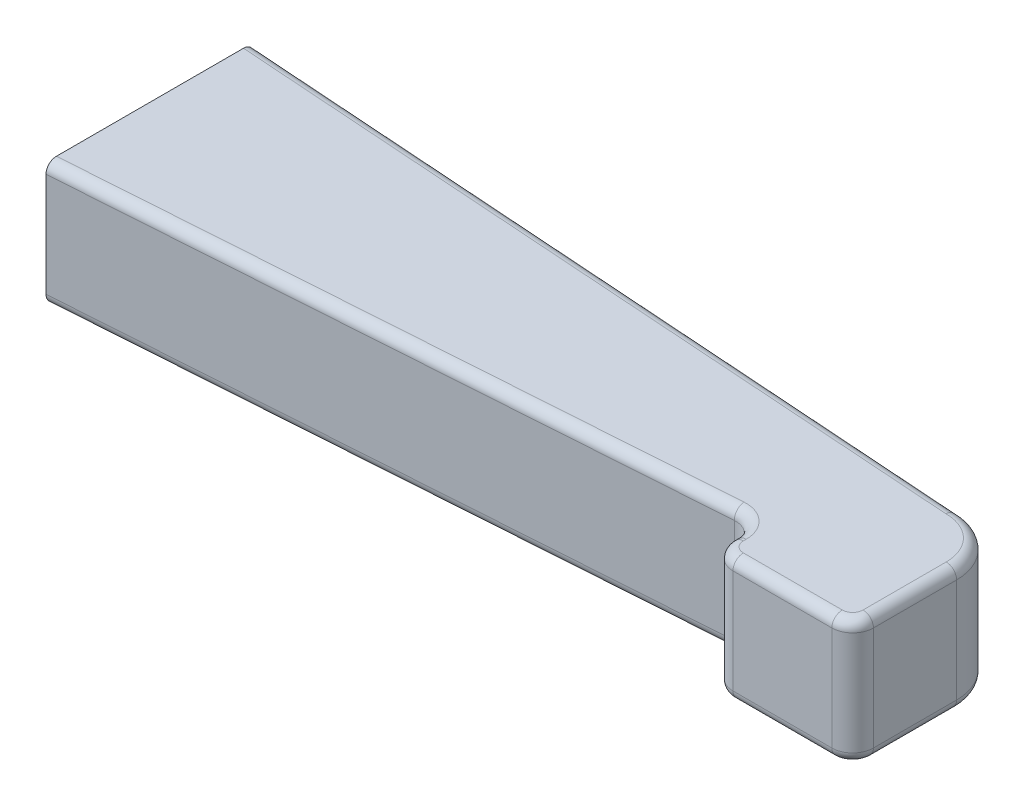
ISO-10303-21;
HEADER;
FILE_DESCRIPTION(('STEP AP214'),'2;1');
FILE_NAME('part.step','',(''),(''),'','','');
FILE_SCHEMA(('AUTOMOTIVE_DESIGN { 1 0 10303 214 1 1 1 1 }'));
ENDSEC;
DATA;
#1=APPLICATION_CONTEXT('core data for automotive mechanical design processes');
#2=APPLICATION_PROTOCOL_DEFINITION('international standard','automotive_design',2000,#1);
#3=PRODUCT_CONTEXT('',#1,'mechanical');
#4=PRODUCT('Part','Part','',(#3));
#5=PRODUCT_RELATED_PRODUCT_CATEGORY('part','',(#4));
#6=PRODUCT_DEFINITION_FORMATION('','',#4);
#7=PRODUCT_DEFINITION_CONTEXT('part definition',#1,'design');
#8=PRODUCT_DEFINITION('design','',#6,#7);
#9=PRODUCT_DEFINITION_SHAPE('','',#8);
#10=(LENGTH_UNIT() NAMED_UNIT(*) SI_UNIT(.MILLI.,.METRE.));
#11=(NAMED_UNIT(*) PLANE_ANGLE_UNIT() SI_UNIT($,.RADIAN.));
#12=(NAMED_UNIT(*) SI_UNIT($,.STERADIAN.) SOLID_ANGLE_UNIT());
#13=UNCERTAINTY_MEASURE_WITH_UNIT(LENGTH_MEASURE(1.E-05),#10,'distance_accuracy_value','');
#14=(GEOMETRIC_REPRESENTATION_CONTEXT(3) GLOBAL_UNCERTAINTY_ASSIGNED_CONTEXT((#13)) GLOBAL_UNIT_ASSIGNED_CONTEXT((#10,
#11,#12)) REPRESENTATION_CONTEXT('',''));
#15=CARTESIAN_POINT('',(0.,0.,0.));
#16=DIRECTION('',(0.,0.,1.));
#17=DIRECTION('',(1.,0.,0.));
#18=AXIS2_PLACEMENT_3D('',#15,#16,#17);
#19=CARTESIAN_POINT('',(0.,6.,0.));
#20=DIRECTION('',(-0.0687070111034064,0.,-0.997636881147262));
#21=DIRECTION('',(-0.997636881147262,0.,0.0687070111034064));
#22=AXIS2_PLACEMENT_3D('',#19,#20,#21);
#23=PLANE('',#22);
#24=DIRECTION('',(0.,-1.,0.));
#25=VECTOR('',#24,1.);
#26=CARTESIAN_POINT('',(0.,6.,0.));
#27=LINE('',#26,#25);
#28=CARTESIAN_POINT('',(0.,5.5,0.));
#29=VERTEX_POINT('',#28);
#30=CARTESIAN_POINT('',(0.,0.5,0.));
#31=VERTEX_POINT('',#30);
#32=EDGE_CURVE('E255',#29,#31,#27,.T.);
#33=ORIENTED_EDGE('',*,*,#32,.T.);
#34=DIRECTION('',(0.997636881147262,0.,-0.0687070111034064));
#35=VECTOR('',#34,1.);
#36=CARTESIAN_POINT('',(30.9748855071722,0.5,-2.13323288531659));
#37=LINE('',#36,#35);
#38=CARTESIAN_POINT('',(30.9748855071722,0.5,-2.13323288531659));
#39=VERTEX_POINT('',#38);
#40=EDGE_CURVE('E11',#31,#39,#37,.T.);
#41=ORIENTED_EDGE('',*,*,#40,.T.);
#42=DIRECTION('',(0.,-1.,0.));
#43=VECTOR('',#42,1.);
#44=CARTESIAN_POINT('',(30.9748855071722,6.,-2.13323288531659));
#45=LINE('',#44,#43);
#46=CARTESIAN_POINT('',(30.9748855071722,5.5,-2.13323288531659));
#47=VERTEX_POINT('',#46);
#48=EDGE_CURVE('E271',#39,#47,#45,.F.);
#49=ORIENTED_EDGE('',*,*,#48,.T.);
#50=DIRECTION('',(0.997636881147262,0.,-0.0687070111034064));
#51=VECTOR('',#50,1.);
#52=CARTESIAN_POINT('',(0.,5.5,0.));
#53=LINE('',#52,#51);
#54=EDGE_CURVE('E53',#47,#29,#53,.F.);
#55=ORIENTED_EDGE('',*,*,#54,.T.);
#56=EDGE_LOOP('',(#33,#41,#49,#55));
#57=FACE_BOUND('',#56,.T.);
#58=ADVANCED_FACE('F39',(#57),#23,.F.);
#59=CARTESIAN_POINT('',(0.,6.,0.));
#60=DIRECTION('',(1.,0.,0.));
#61=DIRECTION('',(0.,0.,-1.));
#62=AXIS2_PLACEMENT_3D('',#59,#60,#61);
#63=PLANE('',#62);
#64=DIRECTION('',(0.,-1.,0.));
#65=VECTOR('',#64,1.);
#66=CARTESIAN_POINT('',(0.,6.,-10.));
#67=LINE('',#66,#65);
#68=CARTESIAN_POINT('',(0.,5.5,-10.));
#69=VERTEX_POINT('',#68);
#70=CARTESIAN_POINT('',(0.,0.5,-10.));
#71=VERTEX_POINT('',#70);
#72=EDGE_CURVE('E259',#69,#71,#67,.T.);
#73=ORIENTED_EDGE('',*,*,#72,.T.);
#74=CARTESIAN_POINT('',(0.,0.5,-9.49881564179443));
#75=DIRECTION('',(1.,0.,0.));
#76=DIRECTION('',(0.,0.,1.));
#77=AXIS2_PLACEMENT_3D('',#74,#75,#76);
#78=ELLIPSE('',#77,0.501184358205573,0.5);
#79=CARTESIAN_POINT('',(0.,0.,-9.49881564179443));
#80=VERTEX_POINT('',#79);
#81=EDGE_CURVE('E334',#71,#80,#78,.F.);
#82=ORIENTED_EDGE('',*,*,#81,.T.);
#83=DIRECTION('',(0.,0.,1.));
#84=VECTOR('',#83,1.);
#85=CARTESIAN_POINT('',(0.,0.,0.));
#86=LINE('',#85,#84);
#87=CARTESIAN_POINT('',(0.,0.,-0.501184358205573));
#88=VERTEX_POINT('',#87);
#89=EDGE_CURVE('E247',#80,#88,#86,.T.);
#90=ORIENTED_EDGE('',*,*,#89,.T.);
#91=CARTESIAN_POINT('',(0.,0.5,-0.501184358205573));
#92=DIRECTION('',(1.,0.,0.));
#93=DIRECTION('',(0.,0.,1.));
#94=AXIS2_PLACEMENT_3D('',#91,#92,#93);
#95=ELLIPSE('',#94,0.501184358205573,0.5);
#96=EDGE_CURVE('E332',#88,#31,#95,.F.);
#97=ORIENTED_EDGE('',*,*,#96,.T.);
#98=ORIENTED_EDGE('',*,*,#32,.F.);
#99=CARTESIAN_POINT('',(0.,5.5,-0.501184358205574));
#100=DIRECTION('',(1.,0.,0.));
#101=DIRECTION('',(0.,0.,-1.));
#102=AXIS2_PLACEMENT_3D('',#99,#100,#101);
#103=ELLIPSE('',#102,0.501184358205573,0.5);
#104=CARTESIAN_POINT('',(0.,6.,-0.501184358205574));
#105=VERTEX_POINT('',#104);
#106=EDGE_CURVE('E328',#29,#105,#103,.F.);
#107=ORIENTED_EDGE('',*,*,#106,.T.);
#108=DIRECTION('',(0.,0.,1.));
#109=VECTOR('',#108,1.);
#110=CARTESIAN_POINT('',(0.,6.,0.));
#111=LINE('',#110,#109);
#112=CARTESIAN_POINT('',(0.,6.,-9.49881564179443));
#113=VERTEX_POINT('',#112);
#114=EDGE_CURVE('E252',#113,#105,#111,.T.);
#115=ORIENTED_EDGE('',*,*,#114,.F.);
#116=CARTESIAN_POINT('',(0.,5.5,-9.49881564179443));
#117=DIRECTION('',(1.,0.,0.));
#118=DIRECTION('',(0.,0.,-1.));
#119=AXIS2_PLACEMENT_3D('',#116,#117,#118);
#120=ELLIPSE('',#119,0.501184358205573,0.5);
#121=EDGE_CURVE('E330',#113,#69,#120,.F.);
#122=ORIENTED_EDGE('',*,*,#121,.T.);
#123=EDGE_LOOP('',(#73,#82,#90,#97,#98,#107,#115,#122));
#124=FACE_BOUND('',#123,.T.);
#125=DIRECTION('',(0.,0.,-1.));
#126=VECTOR('',#125,1.);
#127=CARTESIAN_POINT('',(0.,4.125,-8.25));
#128=LINE('',#127,#126);
#129=CARTESIAN_POINT('',(0.,4.125,-1.75));
#130=VERTEX_POINT('',#129);
#131=CARTESIAN_POINT('',(0.,4.125,-8.25));
#132=VERTEX_POINT('',#131);
#133=EDGE_CURVE('E218',#130,#132,#128,.T.);
#134=ORIENTED_EDGE('',*,*,#133,.F.);
#135=DIRECTION('',(0.,-1.,0.));
#136=VECTOR('',#135,1.);
#137=CARTESIAN_POINT('',(0.,4.125,-1.75));
#138=LINE('',#137,#136);
#139=CARTESIAN_POINT('',(0.,1.875,-1.75));
#140=VERTEX_POINT('',#139);
#141=EDGE_CURVE('E248',#130,#140,#138,.T.);
#142=ORIENTED_EDGE('',*,*,#141,.T.);
#143=DIRECTION('',(0.,0.,-1.));
#144=VECTOR('',#143,1.);
#145=CARTESIAN_POINT('',(0.,1.875,-8.25));
#146=LINE('',#145,#144);
#147=CARTESIAN_POINT('',(0.,1.875,-8.25));
#148=VERTEX_POINT('',#147);
#149=EDGE_CURVE('E231',#140,#148,#146,.T.);
#150=ORIENTED_EDGE('',*,*,#149,.T.);
#151=DIRECTION('',(0.,-1.,0.));
#152=VECTOR('',#151,1.);
#153=CARTESIAN_POINT('',(0.,4.125,-8.25));
#154=LINE('',#153,#152);
#155=EDGE_CURVE('E245',#132,#148,#154,.T.);
#156=ORIENTED_EDGE('',*,*,#155,.F.);
#157=EDGE_LOOP('',(#134,#142,#150,#156));
#158=FACE_BOUND('',#157,.T.);
#159=ADVANCED_FACE('F442',(#124,#158),#63,.F.);
#160=CARTESIAN_POINT('',(36.300403158485,6.,-5.));
#161=DIRECTION('',(0.,-1.,0.));
#162=DIRECTION('',(0.,0.,-1.));
#163=AXIS2_PLACEMENT_3D('',#160,#161,#162);
#164=CYLINDRICAL_SURFACE('',#163,2.5);
#165=DIRECTION('',(0.,1.,0.));
#166=VECTOR('',#165,1.);
#167=CARTESIAN_POINT('',(38.800403158485,6.,-5.));
#168=LINE('',#167,#166);
#169=CARTESIAN_POINT('',(38.800403158485,0.5,-5.));
#170=VERTEX_POINT('',#169);
#171=CARTESIAN_POINT('',(38.800403158485,5.5,-5.));
#172=VERTEX_POINT('',#171);
#173=EDGE_CURVE('E237',#170,#172,#168,.T.);
#174=ORIENTED_EDGE('',*,*,#173,.F.);
#175=CARTESIAN_POINT('',(36.300403158485,0.5,-5.));
#176=DIRECTION('',(0.,-1.,0.));
#177=DIRECTION('',(0.,0.,-1.));
#178=AXIS2_PLACEMENT_3D('',#175,#176,#177);
#179=CIRCLE('',#178,2.5);
#180=CARTESIAN_POINT('',(36.300403158485,0.5,-7.5));
#181=VERTEX_POINT('',#180);
#182=EDGE_CURVE('E338',#170,#181,#179,.F.);
#183=ORIENTED_EDGE('',*,*,#182,.T.);
#184=DIRECTION('',(0.,-1.,0.));
#185=VECTOR('',#184,1.);
#186=CARTESIAN_POINT('',(36.300403158485,6.,-7.5));
#187=LINE('',#186,#185);
#188=CARTESIAN_POINT('',(36.300403158485,5.5,-7.5));
#189=VERTEX_POINT('',#188);
#190=EDGE_CURVE('E262',#189,#181,#187,.T.);
#191=ORIENTED_EDGE('',*,*,#190,.F.);
#192=CARTESIAN_POINT('',(36.300403158485,5.5,-5.));
#193=DIRECTION('',(0.,-1.,0.));
#194=DIRECTION('',(0.,0.,-1.));
#195=AXIS2_PLACEMENT_3D('',#192,#193,#194);
#196=CIRCLE('',#195,2.5);
#197=EDGE_CURVE('E336',#189,#172,#196,.T.);
#198=ORIENTED_EDGE('',*,*,#197,.T.);
#199=EDGE_LOOP('',(#174,#183,#191,#198));
#200=FACE_BOUND('',#199,.T.);
#201=ADVANCED_FACE('F447',(#200),#164,.T.);
#202=CARTESIAN_POINT('',(0.,6.,-10.));
#203=DIRECTION('',(-0.0687070111034064,0.,0.997636881147262));
#204=DIRECTION('',(0.997636881147262,0.,0.0687070111034064));
#205=AXIS2_PLACEMENT_3D('',#202,#203,#204);
#206=PLANE('',#205);
#207=ORIENTED_EDGE('',*,*,#190,.T.);
#208=DIRECTION('',(-0.997636881147262,0.,-0.0687070111034064));
#209=VECTOR('',#208,1.);
#210=CARTESIAN_POINT('',(0.,0.5,-10.));
#211=LINE('',#210,#209);
#212=EDGE_CURVE('E326',#181,#71,#211,.T.);
#213=ORIENTED_EDGE('',*,*,#212,.T.);
#214=ORIENTED_EDGE('',*,*,#72,.F.);
#215=DIRECTION('',(-0.997636881147262,0.,-0.0687070111034064));
#216=VECTOR('',#215,1.);
#217=CARTESIAN_POINT('',(0.,5.5,-10.));
#218=LINE('',#217,#216);
#219=EDGE_CURVE('E324',#69,#189,#218,.F.);
#220=ORIENTED_EDGE('',*,*,#219,.T.);
#221=EDGE_LOOP('',(#207,#213,#214,#220));
#222=FACE_BOUND('',#221,.T.);
#223=ADVANCED_FACE('F503',(#222),#206,.F.);
#224=CARTESIAN_POINT('',(36.300403158485,6.,-5.));
#225=DIRECTION('',(0.,-1.,0.));
#226=DIRECTION('',(0.,0.,-1.));
#227=AXIS2_PLACEMENT_3D('',#224,#225,#226);
#228=PLANE('',#227);
#229=CARTESIAN_POINT('',(36.300403158485,6.,-5.));
#230=DIRECTION('',(0.,-1.,0.));
#231=DIRECTION('',(0.,0.,-1.));
#232=AXIS2_PLACEMENT_3D('',#229,#230,#231);
#233=CIRCLE('',#232,2.);
#234=CARTESIAN_POINT('',(38.300403158485,6.,-5.));
#235=VERTEX_POINT('',#234);
#236=CARTESIAN_POINT('',(36.2841634462838,6.,-6.99993406685011));
#237=VERTEX_POINT('',#236);
#238=EDGE_CURVE('E320',#235,#237,#233,.F.);
#239=ORIENTED_EDGE('',*,*,#238,.T.);
#240=DIRECTION('',(-0.997636881147262,0.,-0.0687070111034064));
#241=VECTOR('',#240,1.);
#242=CARTESIAN_POINT('',(36.4374112736087,6.,-6.98937992598946));
#243=LINE('',#242,#241);
#244=EDGE_CURVE('E322',#237,#113,#243,.T.);
#245=ORIENTED_EDGE('',*,*,#244,.T.);
#246=ORIENTED_EDGE('',*,*,#114,.T.);
#247=DIRECTION('',(0.997636881147262,0.,-0.0687070111034064));
#248=VECTOR('',#247,1.);
#249=CARTESIAN_POINT('',(36.4374112736087,6.,-3.01062007401054));
#250=LINE('',#249,#248);
#251=CARTESIAN_POINT('',(30.9405320016205,6.,-2.63205132589023));
#252=VERTEX_POINT('',#251);
#253=EDGE_CURVE('E306',#105,#252,#250,.T.);
#254=ORIENTED_EDGE('',*,*,#253,.T.);
#255=CARTESIAN_POINT('',(31.0435925182756,6.,-1.13559600416933));
#256=DIRECTION('',(0.,-1.,0.));
#257=DIRECTION('',(0.,0.,-1.));
#258=AXIS2_PLACEMENT_3D('',#255,#256,#257);
#259=CIRCLE('',#258,1.5);
#260=CARTESIAN_POINT('',(32.5435925182756,6.,-1.13559600416933));
#261=VERTEX_POINT('',#260);
#262=EDGE_CURVE('E308',#252,#261,#259,.T.);
#263=ORIENTED_EDGE('',*,*,#262,.T.);
#264=DIRECTION('',(0.,0.,-1.));
#265=VECTOR('',#264,1.);
#266=CARTESIAN_POINT('',(32.5435925182756,6.,-5.));
#267=LINE('',#266,#265);
#268=CARTESIAN_POINT('',(32.5435925182756,6.,-1.));
#269=VERTEX_POINT('',#268);
#270=EDGE_CURVE('E310',#261,#269,#267,.F.);
#271=ORIENTED_EDGE('',*,*,#270,.T.);
#272=CARTESIAN_POINT('',(33.0435925182756,6.,-1.));
#273=DIRECTION('',(0.,-1.,0.));
#274=DIRECTION('',(0.,0.,-1.));
#275=AXIS2_PLACEMENT_3D('',#272,#273,#274);
#276=CIRCLE('',#275,0.5);
#277=CARTESIAN_POINT('',(33.0435925182756,6.,-0.5));
#278=VERTEX_POINT('',#277);
#279=EDGE_CURVE('E312',#269,#278,#276,.F.);
#280=ORIENTED_EDGE('',*,*,#279,.T.);
#281=DIRECTION('',(-1.,0.,0.));
#282=VECTOR('',#281,1.);
#283=CARTESIAN_POINT('',(36.300403158485,6.,-0.5));
#284=LINE('',#283,#282);
#285=CARTESIAN_POINT('',(37.800403158485,6.,-0.5));
#286=VERTEX_POINT('',#285);
#287=EDGE_CURVE('E314',#278,#286,#284,.F.);
#288=ORIENTED_EDGE('',*,*,#287,.T.);
#289=CARTESIAN_POINT('',(37.800403158485,6.,-1.));
#290=DIRECTION('',(0.,-1.,0.));
#291=DIRECTION('',(0.,0.,-1.));
#292=AXIS2_PLACEMENT_3D('',#289,#290,#291);
#293=CIRCLE('',#292,0.5);
#294=CARTESIAN_POINT('',(38.300403158485,6.,-1.));
#295=VERTEX_POINT('',#294);
#296=EDGE_CURVE('E316',#286,#295,#293,.F.);
#297=ORIENTED_EDGE('',*,*,#296,.T.);
#298=DIRECTION('',(0.,0.,-1.));
#299=VECTOR('',#298,1.);
#300=CARTESIAN_POINT('',(38.300403158485,6.,-5.));
#301=LINE('',#300,#299);
#302=EDGE_CURVE('E318',#295,#235,#301,.T.);
#303=ORIENTED_EDGE('',*,*,#302,.T.);
#304=EDGE_LOOP('',(#239,#245,#246,#254,#263,#271,#280,#288,#297,#303));
#305=FACE_BOUND('',#304,.T.);
#306=ADVANCED_FACE('F580',(#305),#228,.F.);
#307=CARTESIAN_POINT('',(36.300403158485,0.,-5.));
#308=DIRECTION('',(0.,-1.,0.));
#309=DIRECTION('',(0.,0.,-1.));
#310=AXIS2_PLACEMENT_3D('',#307,#308,#309);
#311=PLANE('',#310);
#312=ORIENTED_EDGE('',*,*,#89,.F.);
#313=DIRECTION('',(-0.997636881147262,0.,-0.0687070111034064));
#314=VECTOR('',#313,1.);
#315=CARTESIAN_POINT('',(36.2660496529333,0.,-7.00118155942637));
#316=LINE('',#315,#314);
#317=CARTESIAN_POINT('',(36.2841634462838,0.,-6.99993406685011));
#318=VERTEX_POINT('',#317);
#319=EDGE_CURVE('E299',#80,#318,#316,.F.);
#320=ORIENTED_EDGE('',*,*,#319,.T.);
#321=CARTESIAN_POINT('',(36.300403158485,0.,-5.));
#322=DIRECTION('',(0.,-1.,0.));
#323=DIRECTION('',(0.,0.,-1.));
#324=AXIS2_PLACEMENT_3D('',#321,#322,#323);
#325=CIRCLE('',#324,2.);
#326=CARTESIAN_POINT('',(38.300403158485,0.,-5.));
#327=VERTEX_POINT('',#326);
#328=EDGE_CURVE('E297',#318,#327,#325,.T.);
#329=ORIENTED_EDGE('',*,*,#328,.T.);
#330=DIRECTION('',(0.,0.,-1.));
#331=VECTOR('',#330,1.);
#332=CARTESIAN_POINT('',(38.300403158485,0.,-1.));
#333=LINE('',#332,#331);
#334=CARTESIAN_POINT('',(38.300403158485,0.,-1.));
#335=VERTEX_POINT('',#334);
#336=EDGE_CURVE('E295',#327,#335,#333,.F.);
#337=ORIENTED_EDGE('',*,*,#336,.T.);
#338=CARTESIAN_POINT('',(37.800403158485,0.,-1.));
#339=DIRECTION('',(0.,-1.,0.));
#340=DIRECTION('',(0.,0.,-1.));
#341=AXIS2_PLACEMENT_3D('',#338,#339,#340);
#342=CIRCLE('',#341,0.5);
#343=CARTESIAN_POINT('',(37.800403158485,0.,-0.5));
#344=VERTEX_POINT('',#343);
#345=EDGE_CURVE('E293',#335,#344,#342,.T.);
#346=ORIENTED_EDGE('',*,*,#345,.T.);
#347=DIRECTION('',(1.,0.,0.));
#348=VECTOR('',#347,1.);
#349=CARTESIAN_POINT('',(33.0435925182756,0.,-0.5));
#350=LINE('',#349,#348);
#351=CARTESIAN_POINT('',(33.0435925182756,0.,-0.5));
#352=VERTEX_POINT('',#351);
#353=EDGE_CURVE('E291',#344,#352,#350,.F.);
#354=ORIENTED_EDGE('',*,*,#353,.T.);
#355=CARTESIAN_POINT('',(33.0435925182756,0.,-1.));
#356=DIRECTION('',(0.,-1.,0.));
#357=DIRECTION('',(0.,0.,-1.));
#358=AXIS2_PLACEMENT_3D('',#355,#356,#357);
#359=CIRCLE('',#358,0.5);
#360=CARTESIAN_POINT('',(32.5435925182756,0.,-1.));
#361=VERTEX_POINT('',#360);
#362=EDGE_CURVE('E289',#352,#361,#359,.T.);
#363=ORIENTED_EDGE('',*,*,#362,.T.);
#364=DIRECTION('',(0.,0.,-1.));
#365=VECTOR('',#364,1.);
#366=CARTESIAN_POINT('',(32.5435925182756,0.,-1.13559600416933));
#367=LINE('',#366,#365);
#368=CARTESIAN_POINT('',(32.5435925182756,0.,-1.13559600416933));
#369=VERTEX_POINT('',#368);
#370=EDGE_CURVE('E286',#361,#369,#367,.T.);
#371=ORIENTED_EDGE('',*,*,#370,.T.);
#372=CARTESIAN_POINT('',(31.0435925182756,0.,-1.13559600416933));
#373=DIRECTION('',(0.,-1.,0.));
#374=DIRECTION('',(0.,0.,-1.));
#375=AXIS2_PLACEMENT_3D('',#372,#373,#374);
#376=CIRCLE('',#375,1.5);
#377=CARTESIAN_POINT('',(30.9405320016205,0.,-2.63205132589023));
#378=VERTEX_POINT('',#377);
#379=EDGE_CURVE('E284',#369,#378,#376,.F.);
#380=ORIENTED_EDGE('',*,*,#379,.T.);
#381=DIRECTION('',(0.997636881147262,0.,-0.0687070111034064));
#382=VECTOR('',#381,1.);
#383=CARTESIAN_POINT('',(-0.0343535055517032,0.,-0.498818440573631));
#384=LINE('',#383,#382);
#385=EDGE_CURVE('E282',#378,#88,#384,.F.);
#386=ORIENTED_EDGE('',*,*,#385,.T.);
#387=EDGE_LOOP('',(#312,#320,#329,#337,#346,#354,#363,#371,#380,#386));
#388=FACE_BOUND('',#387,.T.);
#389=ADVANCED_FACE('F512',(#388),#311,.T.);
#390=CARTESIAN_POINT('',(0.,4.125,-8.25));
#391=DIRECTION('',(0.0830454798537401,0.,-0.99654575824488));
#392=DIRECTION('',(-0.99654575824488,0.,-0.0830454798537401));
#393=AXIS2_PLACEMENT_3D('',#390,#391,#392);
#394=PLANE('',#393);
#395=DIRECTION('',(0.99654575824488,0.,0.08304547985374));
#396=VECTOR('',#395,1.);
#397=CARTESIAN_POINT('',(0.,1.875,-8.25));
#398=LINE('',#397,#396);
#399=CARTESIAN_POINT('',(12.,1.875,-7.25));
#400=VERTEX_POINT('',#399);
#401=EDGE_CURVE('E213',#148,#400,#398,.T.);
#402=ORIENTED_EDGE('',*,*,#401,.T.);
#403=DIRECTION('',(0.,-1.,0.));
#404=VECTOR('',#403,1.);
#405=CARTESIAN_POINT('',(12.,4.125,-7.25));
#406=LINE('',#405,#404);
#407=CARTESIAN_POINT('',(12.,4.125,-7.25));
#408=VERTEX_POINT('',#407);
#409=EDGE_CURVE('E206',#408,#400,#406,.T.);
#410=ORIENTED_EDGE('',*,*,#409,.F.);
#411=DIRECTION('',(0.99654575824488,0.,0.08304547985374));
#412=VECTOR('',#411,1.);
#413=CARTESIAN_POINT('',(0.,4.125,-8.25));
#414=LINE('',#413,#412);
#415=EDGE_CURVE('E211',#132,#408,#414,.T.);
#416=ORIENTED_EDGE('',*,*,#415,.F.);
#417=ORIENTED_EDGE('',*,*,#155,.T.);
#418=EDGE_LOOP('',(#402,#410,#416,#417));
#419=FACE_BOUND('',#418,.T.);
#420=ADVANCED_FACE('F208',(#419),#394,.F.);
#421=CARTESIAN_POINT('',(0.,4.125,-1.75));
#422=DIRECTION('',(0.08304547985374,0.,0.99654575824488));
#423=DIRECTION('',(0.99654575824488,0.,-0.08304547985374));
#424=AXIS2_PLACEMENT_3D('',#421,#422,#423);
#425=PLANE('',#424);
#426=DIRECTION('',(-0.99654575824488,0.,0.08304547985374));
#427=VECTOR('',#426,1.);
#428=CARTESIAN_POINT('',(0.,1.875,-1.75));
#429=LINE('',#428,#427);
#430=CARTESIAN_POINT('',(12.,1.875,-2.75));
#431=VERTEX_POINT('',#430);
#432=EDGE_CURVE('E234',#431,#140,#429,.T.);
#433=ORIENTED_EDGE('',*,*,#432,.T.);
#434=ORIENTED_EDGE('',*,*,#141,.F.);
#435=DIRECTION('',(-0.99654575824488,0.,0.08304547985374));
#436=VECTOR('',#435,1.);
#437=CARTESIAN_POINT('',(0.,4.125,-1.75));
#438=LINE('',#437,#436);
#439=CARTESIAN_POINT('',(12.,4.125,-2.75));
#440=VERTEX_POINT('',#439);
#441=EDGE_CURVE('E226',#440,#130,#438,.T.);
#442=ORIENTED_EDGE('',*,*,#441,.F.);
#443=DIRECTION('',(0.,-1.,0.));
#444=VECTOR('',#443,1.);
#445=CARTESIAN_POINT('',(12.,4.125,-2.75));
#446=LINE('',#445,#444);
#447=EDGE_CURVE('E217',#440,#431,#446,.T.);
#448=ORIENTED_EDGE('',*,*,#447,.T.);
#449=EDGE_LOOP('',(#433,#434,#442,#448));
#450=FACE_BOUND('',#449,.T.);
#451=ADVANCED_FACE('F593',(#450),#425,.F.);
#452=CARTESIAN_POINT('',(12.,4.125,-5.));
#453=DIRECTION('',(0.,-1.,0.));
#454=DIRECTION('',(0.,0.,-1.));
#455=AXIS2_PLACEMENT_3D('',#452,#453,#454);
#456=CYLINDRICAL_SURFACE('',#455,2.25);
#457=CARTESIAN_POINT('',(12.,1.875,-5.));
#458=DIRECTION('',(0.,-1.,0.));
#459=DIRECTION('',(0.,0.,-1.));
#460=AXIS2_PLACEMENT_3D('',#457,#458,#459);
#461=CIRCLE('',#460,2.25);
#462=EDGE_CURVE('E242',#400,#431,#461,.T.);
#463=ORIENTED_EDGE('',*,*,#462,.T.);
#464=ORIENTED_EDGE('',*,*,#447,.F.);
#465=CARTESIAN_POINT('',(12.,4.125,-5.));
#466=DIRECTION('',(0.,-1.,0.));
#467=DIRECTION('',(0.,0.,-1.));
#468=AXIS2_PLACEMENT_3D('',#465,#466,#467);
#469=CIRCLE('',#468,2.25);
#470=EDGE_CURVE('E221',#408,#440,#469,.T.);
#471=ORIENTED_EDGE('',*,*,#470,.F.);
#472=ORIENTED_EDGE('',*,*,#409,.T.);
#473=EDGE_LOOP('',(#463,#464,#471,#472));
#474=FACE_BOUND('',#473,.T.);
#475=ADVANCED_FACE('F222',(#474),#456,.F.);
#476=CARTESIAN_POINT('',(12.,4.125,-5.));
#477=DIRECTION('',(0.,-1.,0.));
#478=DIRECTION('',(0.,0.,-1.));
#479=AXIS2_PLACEMENT_3D('',#476,#477,#478);
#480=PLANE('',#479);
#481=ORIENTED_EDGE('',*,*,#415,.T.);
#482=ORIENTED_EDGE('',*,*,#470,.T.);
#483=ORIENTED_EDGE('',*,*,#441,.T.);
#484=ORIENTED_EDGE('',*,*,#133,.T.);
#485=EDGE_LOOP('',(#481,#482,#483,#484));
#486=FACE_BOUND('',#485,.T.);
#487=ADVANCED_FACE('F228',(#486),#480,.T.);
#488=CARTESIAN_POINT('',(12.,1.875,-5.));
#489=DIRECTION('',(0.,-1.,0.));
#490=DIRECTION('',(0.,0.,-1.));
#491=AXIS2_PLACEMENT_3D('',#488,#489,#490);
#492=PLANE('',#491);
#493=ORIENTED_EDGE('',*,*,#401,.F.);
#494=ORIENTED_EDGE('',*,*,#149,.F.);
#495=ORIENTED_EDGE('',*,*,#432,.F.);
#496=ORIENTED_EDGE('',*,*,#462,.F.);
#497=EDGE_LOOP('',(#493,#494,#495,#496));
#498=FACE_BOUND('',#497,.T.);
#499=ADVANCED_FACE('F599',(#498),#492,.F.);
#500=CARTESIAN_POINT('',(32.0435925182756,6.,0.));
#501=DIRECTION('',(1.,0.,0.));
#502=DIRECTION('',(0.,0.,-1.));
#503=AXIS2_PLACEMENT_3D('',#500,#501,#502);
#504=PLANE('',#503);
#505=DIRECTION('',(0.,-1.,0.));
#506=VECTOR('',#505,1.);
#507=CARTESIAN_POINT('',(32.0435925182756,0.,-1.13559600416933));
#508=LINE('',#507,#506);
#509=CARTESIAN_POINT('',(32.0435925182756,5.5,-1.13559600416933));
#510=VERTEX_POINT('',#509);
#511=CARTESIAN_POINT('',(32.0435925182756,0.5,-1.13559600416933));
#512=VERTEX_POINT('',#511);
#513=EDGE_CURVE('E268',#510,#512,#508,.T.);
#514=ORIENTED_EDGE('',*,*,#513,.T.);
#515=DIRECTION('',(0.,0.,-1.));
#516=VECTOR('',#515,1.);
#517=CARTESIAN_POINT('',(32.0435925182756,0.5,-1.));
#518=LINE('',#517,#516);
#519=CARTESIAN_POINT('',(32.0435925182756,0.5,-1.));
#520=VERTEX_POINT('',#519);
#521=EDGE_CURVE('E304',#512,#520,#518,.F.);
#522=ORIENTED_EDGE('',*,*,#521,.T.);
#523=DIRECTION('',(0.,-1.,0.));
#524=VECTOR('',#523,1.);
#525=CARTESIAN_POINT('',(32.0435925182756,6.,-1.));
#526=LINE('',#525,#524);
#527=CARTESIAN_POINT('',(32.0435925182756,5.5,-1.));
#528=VERTEX_POINT('',#527);
#529=EDGE_CURVE('E265',#520,#528,#526,.F.);
#530=ORIENTED_EDGE('',*,*,#529,.T.);
#531=DIRECTION('',(0.,0.,-1.));
#532=VECTOR('',#531,1.);
#533=CARTESIAN_POINT('',(32.0435925182756,5.5,0.));
#534=LINE('',#533,#532);
#535=EDGE_CURVE('E301',#528,#510,#534,.T.);
#536=ORIENTED_EDGE('',*,*,#535,.T.);
#537=EDGE_LOOP('',(#514,#522,#530,#536));
#538=FACE_BOUND('',#537,.T.);
#539=ADVANCED_FACE('F520',(#538),#504,.F.);
#540=CARTESIAN_POINT('',(38.800403158485,6.,0.));
#541=DIRECTION('',(-1.,0.,0.));
#542=DIRECTION('',(0.,0.,1.));
#543=AXIS2_PLACEMENT_3D('',#540,#541,#542);
#544=PLANE('',#543);
#545=DIRECTION('',(0.,1.,0.));
#546=VECTOR('',#545,1.);
#547=CARTESIAN_POINT('',(38.800403158485,6.,-1.));
#548=LINE('',#547,#546);
#549=CARTESIAN_POINT('',(38.800403158485,5.5,-1.));
#550=VERTEX_POINT('',#549);
#551=CARTESIAN_POINT('',(38.800403158485,0.5,-1.));
#552=VERTEX_POINT('',#551);
#553=EDGE_CURVE('E279',#550,#552,#548,.F.);
#554=ORIENTED_EDGE('',*,*,#553,.T.);
#555=DIRECTION('',(0.,0.,-1.));
#556=VECTOR('',#555,1.);
#557=CARTESIAN_POINT('',(38.800403158485,0.5,-5.));
#558=LINE('',#557,#556);
#559=EDGE_CURVE('E342',#552,#170,#558,.T.);
#560=ORIENTED_EDGE('',*,*,#559,.T.);
#561=ORIENTED_EDGE('',*,*,#173,.T.);
#562=DIRECTION('',(0.,0.,-1.));
#563=VECTOR('',#562,1.);
#564=CARTESIAN_POINT('',(38.800403158485,5.5,0.));
#565=LINE('',#564,#563);
#566=EDGE_CURVE('E340',#172,#550,#565,.F.);
#567=ORIENTED_EDGE('',*,*,#566,.T.);
#568=EDGE_LOOP('',(#554,#560,#561,#567));
#569=FACE_BOUND('',#568,.T.);
#570=ADVANCED_FACE('F541',(#569),#544,.F.);
#571=CARTESIAN_POINT('',(0.,0.,0.));
#572=DIRECTION('',(0.,0.,-1.));
#573=DIRECTION('',(-1.,0.,0.));
#574=AXIS2_PLACEMENT_3D('',#571,#572,#573);
#575=PLANE('',#574);
#576=DIRECTION('',(0.,-1.,0.));
#577=VECTOR('',#576,1.);
#578=CARTESIAN_POINT('',(33.0435925182756,0.,0.));
#579=LINE('',#578,#577);
#580=CARTESIAN_POINT('',(33.0435925182756,5.5,0.));
#581=VERTEX_POINT('',#580);
#582=CARTESIAN_POINT('',(33.0435925182756,0.5,0.));
#583=VERTEX_POINT('',#582);
#584=EDGE_CURVE('E276',#581,#583,#579,.T.);
#585=ORIENTED_EDGE('',*,*,#584,.T.);
#586=DIRECTION('',(1.,0.,0.));
#587=VECTOR('',#586,1.);
#588=CARTESIAN_POINT('',(37.800403158485,0.5,0.));
#589=LINE('',#588,#587);
#590=CARTESIAN_POINT('',(37.800403158485,0.5,0.));
#591=VERTEX_POINT('',#590);
#592=EDGE_CURVE('E350',#583,#591,#589,.T.);
#593=ORIENTED_EDGE('',*,*,#592,.T.);
#594=DIRECTION('',(0.,1.,0.));
#595=VECTOR('',#594,1.);
#596=CARTESIAN_POINT('',(37.800403158485,0.,0.));
#597=LINE('',#596,#595);
#598=CARTESIAN_POINT('',(37.800403158485,5.5,0.));
#599=VERTEX_POINT('',#598);
#600=EDGE_CURVE('E273',#591,#599,#597,.T.);
#601=ORIENTED_EDGE('',*,*,#600,.T.);
#602=DIRECTION('',(-1.,0.,0.));
#603=VECTOR('',#602,1.);
#604=CARTESIAN_POINT('',(0.,5.5,0.));
#605=LINE('',#604,#603);
#606=EDGE_CURVE('E348',#599,#581,#605,.T.);
#607=ORIENTED_EDGE('',*,*,#606,.T.);
#608=EDGE_LOOP('',(#585,#593,#601,#607));
#609=FACE_BOUND('',#608,.T.);
#610=ADVANCED_FACE('F457',(#609),#575,.F.);
#611=CARTESIAN_POINT('',(31.0435925182756,6.,-1.13559600416933));
#612=DIRECTION('',(0.,1.,0.));
#613=DIRECTION('',(0.,0.,1.));
#614=AXIS2_PLACEMENT_3D('',#611,#612,#613);
#615=CYLINDRICAL_SURFACE('',#614,1.);
#616=ORIENTED_EDGE('',*,*,#48,.F.);
#617=CARTESIAN_POINT('',(31.0435925182756,0.5,-1.13559600416933));
#618=DIRECTION('',(0.,-1.,0.));
#619=DIRECTION('',(0.,0.,-1.));
#620=AXIS2_PLACEMENT_3D('',#617,#618,#619);
#621=CIRCLE('',#620,1.);
#622=EDGE_CURVE('E357',#39,#512,#621,.T.);
#623=ORIENTED_EDGE('',*,*,#622,.T.);
#624=ORIENTED_EDGE('',*,*,#513,.F.);
#625=CARTESIAN_POINT('',(31.0435925182756,5.5,-1.13559600416933));
#626=DIRECTION('',(0.,-1.,0.));
#627=DIRECTION('',(0.,0.,-1.));
#628=AXIS2_PLACEMENT_3D('',#625,#626,#627);
#629=CIRCLE('',#628,1.);
#630=EDGE_CURVE('E61',#510,#47,#629,.F.);
#631=ORIENTED_EDGE('',*,*,#630,.T.);
#632=EDGE_LOOP('',(#616,#623,#624,#631));
#633=FACE_BOUND('',#632,.T.);
#634=ADVANCED_FACE('F453',(#633),#615,.F.);
#635=CARTESIAN_POINT('',(33.0435925182756,0.,-1.));
#636=DIRECTION('',(0.,-1.,0.));
#637=DIRECTION('',(0.,0.,-1.));
#638=AXIS2_PLACEMENT_3D('',#635,#636,#637);
#639=CYLINDRICAL_SURFACE('',#638,1.);
#640=ORIENTED_EDGE('',*,*,#529,.F.);
#641=CARTESIAN_POINT('',(33.0435925182756,0.5,-1.));
#642=DIRECTION('',(0.,-1.,0.));
#643=DIRECTION('',(0.,0.,-1.));
#644=AXIS2_PLACEMENT_3D('',#641,#642,#643);
#645=CIRCLE('',#644,1.);
#646=EDGE_CURVE('E354',#520,#583,#645,.F.);
#647=ORIENTED_EDGE('',*,*,#646,.T.);
#648=ORIENTED_EDGE('',*,*,#584,.F.);
#649=CARTESIAN_POINT('',(33.0435925182756,5.5,-1.));
#650=DIRECTION('',(0.,-1.,0.));
#651=DIRECTION('',(0.,0.,-1.));
#652=AXIS2_PLACEMENT_3D('',#649,#650,#651);
#653=CIRCLE('',#652,1.);
#654=EDGE_CURVE('E352',#581,#528,#653,.T.);
#655=ORIENTED_EDGE('',*,*,#654,.T.);
#656=EDGE_LOOP('',(#640,#647,#648,#655));
#657=FACE_BOUND('',#656,.T.);
#658=ADVANCED_FACE('F456',(#657),#639,.T.);
#659=CARTESIAN_POINT('',(37.800403158485,0.,-1.));
#660=DIRECTION('',(0.,1.,0.));
#661=DIRECTION('',(0.,0.,1.));
#662=AXIS2_PLACEMENT_3D('',#659,#660,#661);
#663=CYLINDRICAL_SURFACE('',#662,1.);
#664=ORIENTED_EDGE('',*,*,#600,.F.);
#665=CARTESIAN_POINT('',(37.800403158485,0.5,-1.));
#666=DIRECTION('',(0.,-1.,0.));
#667=DIRECTION('',(0.,0.,-1.));
#668=AXIS2_PLACEMENT_3D('',#665,#666,#667);
#669=CIRCLE('',#668,1.);
#670=EDGE_CURVE('E346',#591,#552,#669,.F.);
#671=ORIENTED_EDGE('',*,*,#670,.T.);
#672=ORIENTED_EDGE('',*,*,#553,.F.);
#673=CARTESIAN_POINT('',(37.800403158485,5.5,-1.));
#674=DIRECTION('',(0.,-1.,0.));
#675=DIRECTION('',(0.,0.,-1.));
#676=AXIS2_PLACEMENT_3D('',#673,#674,#675);
#677=CIRCLE('',#676,1.);
#678=EDGE_CURVE('E344',#550,#599,#677,.T.);
#679=ORIENTED_EDGE('',*,*,#678,.T.);
#680=EDGE_LOOP('',(#664,#671,#672,#679));
#681=FACE_BOUND('',#680,.T.);
#682=ADVANCED_FACE('F398',(#681),#663,.T.);
#683=CARTESIAN_POINT('',(-0.0343535055517032,0.5,-9.50118155942637));
#684=DIRECTION('',(0.997636881147262,0.,0.0687070111034064));
#685=DIRECTION('',(0.0687070111034064,0.,-0.997636881147262));
#686=AXIS2_PLACEMENT_3D('',#683,#684,#685);
#687=CYLINDRICAL_SURFACE('',#686,0.5);
#688=ORIENTED_EDGE('',*,*,#81,.F.);
#689=ORIENTED_EDGE('',*,*,#212,.F.);
#690=CARTESIAN_POINT('',(36.300403158485,0.5,-7.5));
#691=CARTESIAN_POINT('',(36.3004042189784,0.471884294225136,-7.50002393229458));
#692=CARTESIAN_POINT('',(36.3003216480655,0.443775809818253,-7.49762995764211));
#693=CARTESIAN_POINT('',(36.2999970487012,0.388374010156819,-7.48818253972902));
#694=CARTESIAN_POINT('',(36.2997551363274,0.361080116605228,-7.48113248833038));
#695=CARTESIAN_POINT('',(36.2991194875629,0.308052452118057,-7.46254438033408));
#696=CARTESIAN_POINT('',(36.2987256791494,0.282319427989687,-7.45100419468085));
#697=CARTESIAN_POINT('',(36.2978011202777,0.233162420719299,-7.42377513454567));
#698=CARTESIAN_POINT('',(36.2972704031586,0.20973787734881,-7.40808727005422));
#699=CARTESIAN_POINT('',(36.2960910500057,0.165850720937253,-7.37300257527851));
#700=CARTESIAN_POINT('',(36.2954423931159,0.145388632922733,-7.35360508896011));
#701=CARTESIAN_POINT('',(36.2940501569016,0.108003045360936,-7.31164506035477));
#702=CARTESIAN_POINT('',(36.2933065411963,0.0910809086369222,-7.28908130467093));
#703=CARTESIAN_POINT('',(36.2917501212935,0.0612504792258816,-7.24141740340754));
#704=CARTESIAN_POINT('',(36.2909372539776,0.0483458992242771,-7.2163149399773));
#705=CARTESIAN_POINT('',(36.2892711826716,0.0269466842943457,-7.16431523533704));
#706=CARTESIAN_POINT('',(36.2884180236175,0.0184472575065947,-7.13741998040728));
#707=CARTESIAN_POINT('',(36.287075401158,0.00878106641718715,-7.09459021209611));
#708=CARTESIAN_POINT('',(36.2865896939169,0.00603299965357208,-7.07899427031012));
#709=CARTESIAN_POINT('',(36.2856196226261,0.00202838562461001,-7.04762596535668));
#710=CARTESIAN_POINT('',(36.2851352576496,0.000769873087809384,-7.03185386242366));
#711=CARTESIAN_POINT('',(36.2844900299211,8.65388914075558E-05,-7.01068807152204));
#712=CARTESIAN_POINT('',(36.2843265117447,-2.37612808075619E-07,-7.00531055010769));
#713=CARTESIAN_POINT('',(36.2841634463121,0.,-6.99993406685034));
#714=B_SPLINE_CURVE_WITH_KNOTS('',3,(#690,#691,#692,#693,#694,#695,#696,#697,#698,#699,#700,
#701,#702,#703,#704,#705,#706,#707,#708,#709,#710,#711,#712,#713),.UNSPECIFIED.,.F.,.F.,(4,2,2,
2,2,2,2,2,2,2,2,4),(0.,0.0842348997345687,0.168408503558116,0.252622068125806,0.336815144924417,
0.421023124776723,0.505263463901581,0.589581421304463,0.673807465375239,0.721278788693783,
0.768687409760409,0.784826367431802),.UNSPECIFIED.);
#715=EDGE_CURVE('E380',#318,#181,#714,.F.);
#716=ORIENTED_EDGE('',*,*,#715,.F.);
#717=ORIENTED_EDGE('',*,*,#319,.F.);
#718=EDGE_LOOP('',(#688,#689,#716,#717));
#719=FACE_BOUND('',#718,.T.);
#720=ADVANCED_FACE('F394',(#719),#687,.T.);
#721=CARTESIAN_POINT('',(36.300403158485,0.5,-5.));
#722=DIRECTION('',(0.,-1.,0.));
#723=DIRECTION('',(0.,0.,-1.));
#724=AXIS2_PLACEMENT_3D('',#721,#722,#723);
#725=TOROIDAL_SURFACE('',#724,2.,0.5);
#726=ORIENTED_EDGE('',*,*,#715,.T.);
#727=ORIENTED_EDGE('',*,*,#182,.F.);
#728=CARTESIAN_POINT('',(38.300403158485,0.5,-5.));
#729=DIRECTION('',(0.,0.,1.));
#730=DIRECTION('',(1.,0.,0.));
#731=AXIS2_PLACEMENT_3D('',#728,#729,#730);
#732=CIRCLE('',#731,0.5);
#733=EDGE_CURVE('E377',#327,#170,#732,.T.);
#734=ORIENTED_EDGE('',*,*,#733,.F.);
#735=ORIENTED_EDGE('',*,*,#328,.F.);
#736=EDGE_LOOP('',(#726,#727,#734,#735));
#737=FACE_BOUND('',#736,.T.);
#738=ADVANCED_FACE('F391',(#737),#725,.T.);
#739=CARTESIAN_POINT('',(38.300403158485,0.5,0.));
#740=DIRECTION('',(0.,0.,1.));
#741=DIRECTION('',(1.,0.,0.));
#742=AXIS2_PLACEMENT_3D('',#739,#740,#741);
#743=CYLINDRICAL_SURFACE('',#742,0.5);
#744=ORIENTED_EDGE('',*,*,#733,.T.);
#745=ORIENTED_EDGE('',*,*,#559,.F.);
#746=CARTESIAN_POINT('',(38.300403158485,0.5,-1.));
#747=DIRECTION('',(0.,0.,1.));
#748=DIRECTION('',(1.,0.,0.));
#749=AXIS2_PLACEMENT_3D('',#746,#747,#748);
#750=CIRCLE('',#749,0.5);
#751=EDGE_CURVE('E374',#335,#552,#750,.T.);
#752=ORIENTED_EDGE('',*,*,#751,.F.);
#753=ORIENTED_EDGE('',*,*,#336,.F.);
#754=EDGE_LOOP('',(#744,#745,#752,#753));
#755=FACE_BOUND('',#754,.T.);
#756=ADVANCED_FACE('F481',(#755),#743,.T.);
#757=CARTESIAN_POINT('',(37.800403158485,0.5,-1.));
#758=DIRECTION('',(0.,-1.,0.));
#759=DIRECTION('',(0.,0.,-1.));
#760=AXIS2_PLACEMENT_3D('',#757,#758,#759);
#761=DEGENERATE_TOROIDAL_SURFACE('',#760,0.5,0.5,.T.);
#762=ORIENTED_EDGE('',*,*,#751,.T.);
#763=ORIENTED_EDGE('',*,*,#670,.F.);
#764=CARTESIAN_POINT('',(37.800403158485,0.5,-0.5));
#765=DIRECTION('',(-1.,0.,0.));
#766=DIRECTION('',(0.,0.,1.));
#767=AXIS2_PLACEMENT_3D('',#764,#765,#766);
#768=CIRCLE('',#767,0.5);
#769=EDGE_CURVE('E371',#344,#591,#768,.T.);
#770=ORIENTED_EDGE('',*,*,#769,.F.);
#771=ORIENTED_EDGE('',*,*,#345,.F.);
#772=EDGE_LOOP('',(#762,#763,#770,#771));
#773=FACE_BOUND('',#772,.T.);
#774=ADVANCED_FACE('F478',(#773),#761,.T.);
#775=CARTESIAN_POINT('',(0.,0.5,-0.5));
#776=DIRECTION('',(-1.,0.,0.));
#777=DIRECTION('',(0.,0.,1.));
#778=AXIS2_PLACEMENT_3D('',#775,#776,#777);
#779=CYLINDRICAL_SURFACE('',#778,0.5);
#780=ORIENTED_EDGE('',*,*,#769,.T.);
#781=ORIENTED_EDGE('',*,*,#592,.F.);
#782=CARTESIAN_POINT('',(33.0435925182756,0.5,-0.5));
#783=DIRECTION('',(-1.,0.,0.));
#784=DIRECTION('',(0.,0.,1.));
#785=AXIS2_PLACEMENT_3D('',#782,#783,#784);
#786=CIRCLE('',#785,0.5);
#787=EDGE_CURVE('E368',#352,#583,#786,.T.);
#788=ORIENTED_EDGE('',*,*,#787,.F.);
#789=ORIENTED_EDGE('',*,*,#353,.F.);
#790=EDGE_LOOP('',(#780,#781,#788,#789));
#791=FACE_BOUND('',#790,.T.);
#792=ADVANCED_FACE('F474',(#791),#779,.T.);
#793=CARTESIAN_POINT('',(-0.0343535055517032,0.5,-0.498818440573631));
#794=DIRECTION('',(-0.997636881147262,0.,0.0687070111034064));
#795=DIRECTION('',(0.0687070111034064,0.,0.997636881147262));
#796=AXIS2_PLACEMENT_3D('',#793,#794,#795);
#797=CYLINDRICAL_SURFACE('',#796,0.5);
#798=ORIENTED_EDGE('',*,*,#96,.F.);
#799=ORIENTED_EDGE('',*,*,#385,.F.);
#800=CARTESIAN_POINT('',(30.9405320016205,0.5,-2.63205132589023));
#801=DIRECTION('',(0.997636881147262,0.,-0.0687070111034041));
#802=DIRECTION('',(-0.0687070111034041,0.,-0.997636881147262));
#803=AXIS2_PLACEMENT_3D('',#800,#801,#802);
#804=CIRCLE('',#803,0.5);
#805=EDGE_CURVE('E365',#39,#378,#804,.T.);
#806=ORIENTED_EDGE('',*,*,#805,.F.);
#807=ORIENTED_EDGE('',*,*,#40,.F.);
#808=EDGE_LOOP('',(#798,#799,#806,#807));
#809=FACE_BOUND('',#808,.T.);
#810=ADVANCED_FACE('F470',(#809),#797,.T.);
#811=CARTESIAN_POINT('',(33.0435925182756,0.5,-1.));
#812=DIRECTION('',(0.,-1.,0.));
#813=DIRECTION('',(0.,0.,-1.));
#814=AXIS2_PLACEMENT_3D('',#811,#812,#813);
#815=DEGENERATE_TOROIDAL_SURFACE('',#814,0.5,0.5,.T.);
#816=ORIENTED_EDGE('',*,*,#787,.T.);
#817=ORIENTED_EDGE('',*,*,#646,.F.);
#818=CARTESIAN_POINT('',(32.5435925182756,0.5,-1.));
#819=DIRECTION('',(0.,0.,-1.));
#820=DIRECTION('',(-1.,0.,0.));
#821=AXIS2_PLACEMENT_3D('',#818,#819,#820);
#822=CIRCLE('',#821,0.5);
#823=EDGE_CURVE('E362',#361,#520,#822,.T.);
#824=ORIENTED_EDGE('',*,*,#823,.F.);
#825=ORIENTED_EDGE('',*,*,#362,.F.);
#826=EDGE_LOOP('',(#816,#817,#824,#825));
#827=FACE_BOUND('',#826,.T.);
#828=ADVANCED_FACE('F466',(#827),#815,.T.);
#829=CARTESIAN_POINT('',(31.0435925182756,0.5,-1.13559600416933));
#830=DIRECTION('',(0.,-1.,0.));
#831=DIRECTION('',(0.,0.,-1.));
#832=AXIS2_PLACEMENT_3D('',#829,#830,#831);
#833=TOROIDAL_SURFACE('',#832,1.5,0.5);
#834=ORIENTED_EDGE('',*,*,#805,.T.);
#835=ORIENTED_EDGE('',*,*,#379,.F.);
#836=CARTESIAN_POINT('',(32.5435925182756,0.5,-1.13559600416933));
#837=DIRECTION('',(0.,0.,1.));
#838=DIRECTION('',(1.,0.,0.));
#839=AXIS2_PLACEMENT_3D('',#836,#837,#838);
#840=CIRCLE('',#839,0.5);
#841=EDGE_CURVE('E360',#512,#369,#840,.T.);
#842=ORIENTED_EDGE('',*,*,#841,.F.);
#843=ORIENTED_EDGE('',*,*,#622,.F.);
#844=EDGE_LOOP('',(#834,#835,#842,#843));
#845=FACE_BOUND('',#844,.T.);
#846=ADVANCED_FACE('F437',(#845),#833,.T.);
#847=CARTESIAN_POINT('',(32.5435925182756,0.5,-5.));
#848=DIRECTION('',(0.,0.,1.));
#849=DIRECTION('',(1.,0.,0.));
#850=AXIS2_PLACEMENT_3D('',#847,#848,#849);
#851=CYLINDRICAL_SURFACE('',#850,0.5);
#852=ORIENTED_EDGE('',*,*,#823,.T.);
#853=ORIENTED_EDGE('',*,*,#521,.F.);
#854=ORIENTED_EDGE('',*,*,#841,.T.);
#855=ORIENTED_EDGE('',*,*,#370,.F.);
#856=EDGE_LOOP('',(#852,#853,#854,#855));
#857=FACE_BOUND('',#856,.T.);
#858=ADVANCED_FACE('F430',(#857),#851,.T.);
#859=CARTESIAN_POINT('',(36.4374112736087,5.5,-6.98937992598946));
#860=DIRECTION('',(-0.997636881147262,0.,-0.0687070111034064));
#861=DIRECTION('',(-0.0687070111034064,0.,0.997636881147262));
#862=AXIS2_PLACEMENT_3D('',#859,#860,#861);
#863=CYLINDRICAL_SURFACE('',#862,0.5);
#864=ORIENTED_EDGE('',*,*,#121,.F.);
#865=ORIENTED_EDGE('',*,*,#244,.F.);
#866=CARTESIAN_POINT('',(36.300403158485,5.5,-7.5));
#867=CARTESIAN_POINT('',(36.3004042189784,5.52811570577486,-7.50002393229458));
#868=CARTESIAN_POINT('',(36.3003216480655,5.55622419018175,-7.49762995764211));
#869=CARTESIAN_POINT('',(36.2999970487012,5.61162598984318,-7.48818253972902));
#870=CARTESIAN_POINT('',(36.2997551363274,5.63891988339477,-7.48113248833038));
#871=CARTESIAN_POINT('',(36.2991194875629,5.69194754788194,-7.46254438033409));
#872=CARTESIAN_POINT('',(36.2987256791494,5.71768057201031,-7.45100419468085));
#873=CARTESIAN_POINT('',(36.2978011202777,5.7668375792807,-7.42377513454567));
#874=CARTESIAN_POINT('',(36.2972704031586,5.79026212265119,-7.40808727005422));
#875=CARTESIAN_POINT('',(36.2960910500057,5.83414927906275,-7.37300257527851));
#876=CARTESIAN_POINT('',(36.2954423931159,5.85461136707727,-7.35360508896011));
#877=CARTESIAN_POINT('',(36.2940501569015,5.89199695463906,-7.31164506035477));
#878=CARTESIAN_POINT('',(36.2933065411963,5.90891909136308,-7.28908130467093));
#879=CARTESIAN_POINT('',(36.2917501212935,5.93874952077412,-7.24141740340754));
#880=CARTESIAN_POINT('',(36.2909372539776,5.95165410077572,-7.2163149399773));
#881=CARTESIAN_POINT('',(36.2892711826716,5.97305331570565,-7.16431523533704));
#882=CARTESIAN_POINT('',(36.2884180236175,5.9815527424934,-7.13741998040728));
#883=CARTESIAN_POINT('',(36.287075401158,5.99121893358281,-7.09459021209611));
#884=CARTESIAN_POINT('',(36.2865896939169,5.99396700034643,-7.07899427031012));
#885=CARTESIAN_POINT('',(36.2856196226261,5.99797161437539,-7.04762596535668));
#886=CARTESIAN_POINT('',(36.2851352576496,5.99923012691219,-7.03185386242366));
#887=CARTESIAN_POINT('',(36.2844900299211,5.99991346110859,-7.01068807152204));
#888=CARTESIAN_POINT('',(36.2843265117447,6.00000023761281,-7.00531055010769));
#889=CARTESIAN_POINT('',(36.2841634463121,6.,-6.99993406685034));
#890=B_SPLINE_CURVE_WITH_KNOTS('',3,(#866,#867,#868,#869,#870,#871,#872,#873,#874,#875,#876,
#877,#878,#879,#880,#881,#882,#883,#884,#885,#886,#887,#888,#889),.UNSPECIFIED.,.F.,.F.,(4,2,2,
2,2,2,2,2,2,2,2,4),(0.,0.0842348997345691,0.168408503558115,0.252622068125805,0.336815144924417,
0.421023124776722,0.50526346390158,0.589581421304463,0.673807465375238,0.721278788693784,
0.76868740976041,0.784826367431802),.UNSPECIFIED.);
#891=EDGE_CURVE('E44',#189,#237,#890,.T.);
#892=ORIENTED_EDGE('',*,*,#891,.F.);
#893=ORIENTED_EDGE('',*,*,#219,.F.);
#894=EDGE_LOOP('',(#864,#865,#892,#893));
#895=FACE_BOUND('',#894,.T.);
#896=ADVANCED_FACE('F427',(#895),#863,.T.);
#897=CARTESIAN_POINT('',(36.300403158485,5.5,-5.));
#898=DIRECTION('',(0.,-1.,0.));
#899=DIRECTION('',(0.,0.,-1.));
#900=AXIS2_PLACEMENT_3D('',#897,#898,#899);
#901=TOROIDAL_SURFACE('',#900,2.,0.5);
#902=ORIENTED_EDGE('',*,*,#891,.T.);
#903=ORIENTED_EDGE('',*,*,#238,.F.);
#904=CARTESIAN_POINT('',(38.300403158485,5.5,-5.));
#905=DIRECTION('',(0.,0.,1.));
#906=DIRECTION('',(1.,0.,0.));
#907=AXIS2_PLACEMENT_3D('',#904,#905,#906);
#908=CIRCLE('',#907,0.5);
#909=EDGE_CURVE('E546',#172,#235,#908,.T.);
#910=ORIENTED_EDGE('',*,*,#909,.F.);
#911=ORIENTED_EDGE('',*,*,#197,.F.);
#912=EDGE_LOOP('',(#902,#903,#910,#911));
#913=FACE_BOUND('',#912,.T.);
#914=ADVANCED_FACE('F41',(#913),#901,.T.);
#915=CARTESIAN_POINT('',(38.300403158485,5.5,-5.));
#916=DIRECTION('',(0.,0.,-1.));
#917=DIRECTION('',(-1.,0.,0.));
#918=AXIS2_PLACEMENT_3D('',#915,#916,#917);
#919=CYLINDRICAL_SURFACE('',#918,0.5);
#920=ORIENTED_EDGE('',*,*,#909,.T.);
#921=ORIENTED_EDGE('',*,*,#302,.F.);
#922=CARTESIAN_POINT('',(38.300403158485,5.5,-1.));
#923=DIRECTION('',(0.,0.,1.));
#924=DIRECTION('',(1.,0.,0.));
#925=AXIS2_PLACEMENT_3D('',#922,#923,#924);
#926=CIRCLE('',#925,0.5);
#927=EDGE_CURVE('E548',#550,#295,#926,.T.);
#928=ORIENTED_EDGE('',*,*,#927,.F.);
#929=ORIENTED_EDGE('',*,*,#566,.F.);
#930=EDGE_LOOP('',(#920,#921,#928,#929));
#931=FACE_BOUND('',#930,.T.);
#932=ADVANCED_FACE('F423',(#931),#919,.T.);
#933=CARTESIAN_POINT('',(37.800403158485,5.5,-1.));
#934=DIRECTION('',(0.,-1.,0.));
#935=DIRECTION('',(0.,0.,-1.));
#936=AXIS2_PLACEMENT_3D('',#933,#934,#935);
#937=DEGENERATE_TOROIDAL_SURFACE('',#936,0.5,0.5,.T.);
#938=ORIENTED_EDGE('',*,*,#927,.T.);
#939=ORIENTED_EDGE('',*,*,#296,.F.);
#940=CARTESIAN_POINT('',(37.800403158485,5.5,-0.5));
#941=DIRECTION('',(-1.,0.,0.));
#942=DIRECTION('',(0.,0.,1.));
#943=AXIS2_PLACEMENT_3D('',#940,#941,#942);
#944=CIRCLE('',#943,0.5);
#945=EDGE_CURVE('E551',#599,#286,#944,.T.);
#946=ORIENTED_EDGE('',*,*,#945,.F.);
#947=ORIENTED_EDGE('',*,*,#678,.F.);
#948=EDGE_LOOP('',(#938,#939,#946,#947));
#949=FACE_BOUND('',#948,.T.);
#950=ADVANCED_FACE('F419',(#949),#937,.T.);
#951=CARTESIAN_POINT('',(0.,5.5,-0.5));
#952=DIRECTION('',(-1.,0.,0.));
#953=DIRECTION('',(0.,0.,1.));
#954=AXIS2_PLACEMENT_3D('',#951,#952,#953);
#955=CYLINDRICAL_SURFACE('',#954,0.5);
#956=ORIENTED_EDGE('',*,*,#945,.T.);
#957=ORIENTED_EDGE('',*,*,#287,.F.);
#958=CARTESIAN_POINT('',(33.0435925182756,5.5,-0.5));
#959=DIRECTION('',(-1.,0.,0.));
#960=DIRECTION('',(0.,0.,1.));
#961=AXIS2_PLACEMENT_3D('',#958,#959,#960);
#962=CIRCLE('',#961,0.5);
#963=EDGE_CURVE('E556',#581,#278,#962,.T.);
#964=ORIENTED_EDGE('',*,*,#963,.F.);
#965=ORIENTED_EDGE('',*,*,#606,.F.);
#966=EDGE_LOOP('',(#956,#957,#964,#965));
#967=FACE_BOUND('',#966,.T.);
#968=ADVANCED_FACE('F415',(#967),#955,.T.);
#969=CARTESIAN_POINT('',(36.4374112736087,5.5,-3.01062007401054));
#970=DIRECTION('',(0.997636881147262,0.,-0.0687070111034064));
#971=DIRECTION('',(-0.0687070111034064,0.,-0.997636881147262));
#972=AXIS2_PLACEMENT_3D('',#969,#970,#971);
#973=CYLINDRICAL_SURFACE('',#972,0.5);
#974=ORIENTED_EDGE('',*,*,#106,.F.);
#975=ORIENTED_EDGE('',*,*,#54,.F.);
#976=CARTESIAN_POINT('',(30.9405320016205,5.5,-2.63205132589023));
#977=DIRECTION('',(0.997636881147262,0.,-0.068707011103404));
#978=DIRECTION('',(-0.068707011103404,0.,-0.997636881147262));
#979=AXIS2_PLACEMENT_3D('',#976,#977,#978);
#980=CIRCLE('',#979,0.5);
#981=EDGE_CURVE('E561',#252,#47,#980,.T.);
#982=ORIENTED_EDGE('',*,*,#981,.F.);
#983=ORIENTED_EDGE('',*,*,#253,.F.);
#984=EDGE_LOOP('',(#974,#975,#982,#983));
#985=FACE_BOUND('',#984,.T.);
#986=ADVANCED_FACE('F411',(#985),#973,.T.);
#987=CARTESIAN_POINT('',(33.0435925182756,5.5,-1.));
#988=DIRECTION('',(0.,-1.,0.));
#989=DIRECTION('',(0.,0.,-1.));
#990=AXIS2_PLACEMENT_3D('',#987,#988,#989);
#991=DEGENERATE_TOROIDAL_SURFACE('',#990,0.5,0.5,.T.);
#992=ORIENTED_EDGE('',*,*,#963,.T.);
#993=ORIENTED_EDGE('',*,*,#279,.F.);
#994=CARTESIAN_POINT('',(32.5435925182756,5.5,-1.));
#995=DIRECTION('',(0.,0.,-1.));
#996=DIRECTION('',(-1.,0.,0.));
#997=AXIS2_PLACEMENT_3D('',#994,#995,#996);
#998=CIRCLE('',#997,0.5);
#999=EDGE_CURVE('E565',#528,#269,#998,.T.);
#1000=ORIENTED_EDGE('',*,*,#999,.F.);
#1001=ORIENTED_EDGE('',*,*,#654,.F.);
#1002=EDGE_LOOP('',(#992,#993,#1000,#1001));
#1003=FACE_BOUND('',#1002,.T.);
#1004=ADVANCED_FACE('F407',(#1003),#991,.T.);
#1005=CARTESIAN_POINT('',(31.0435925182756,5.5,-1.13559600416933));
#1006=DIRECTION('',(0.,-1.,0.));
#1007=DIRECTION('',(0.,0.,-1.));
#1008=AXIS2_PLACEMENT_3D('',#1005,#1006,#1007);
#1009=TOROIDAL_SURFACE('',#1008,1.5,0.5);
#1010=ORIENTED_EDGE('',*,*,#981,.T.);
#1011=ORIENTED_EDGE('',*,*,#630,.F.);
#1012=CARTESIAN_POINT('',(32.5435925182756,5.5,-1.13559600416933));
#1013=DIRECTION('',(0.,0.,1.));
#1014=DIRECTION('',(1.,0.,0.));
#1015=AXIS2_PLACEMENT_3D('',#1012,#1013,#1014);
#1016=CIRCLE('',#1015,0.5);
#1017=EDGE_CURVE('E389',#261,#510,#1016,.T.);
#1018=ORIENTED_EDGE('',*,*,#1017,.F.);
#1019=ORIENTED_EDGE('',*,*,#262,.F.);
#1020=EDGE_LOOP('',(#1010,#1011,#1018,#1019));
#1021=FACE_BOUND('',#1020,.T.);
#1022=ADVANCED_FACE('F403',(#1021),#1009,.T.);
#1023=CARTESIAN_POINT('',(32.5435925182756,5.5,0.));
#1024=DIRECTION('',(0.,0.,-1.));
#1025=DIRECTION('',(-1.,0.,0.));
#1026=AXIS2_PLACEMENT_3D('',#1023,#1024,#1025);
#1027=CYLINDRICAL_SURFACE('',#1026,0.5);
#1028=ORIENTED_EDGE('',*,*,#999,.T.);
#1029=ORIENTED_EDGE('',*,*,#270,.F.);
#1030=ORIENTED_EDGE('',*,*,#1017,.T.);
#1031=ORIENTED_EDGE('',*,*,#535,.F.);
#1032=EDGE_LOOP('',(#1028,#1029,#1030,#1031));
#1033=FACE_BOUND('',#1032,.T.);
#1034=ADVANCED_FACE('F400',(#1033),#1027,.T.);
#1035=CLOSED_SHELL('',(#58,#159,#201,#223,#306,#389,#420,#451,#475,#487,#499,#539,#570,#610,
#634,#658,#682,#720,#738,#756,#774,#792,#810,#828,#846,#858,#896,#914,#932,#950,#968,#986,#1004,
#1022,#1034));
#1036=MANIFOLD_SOLID_BREP('B2',#1035);
#1037=ADVANCED_BREP_SHAPE_REPRESENTATION('',(#18,#1036),#14);
#1038=SHAPE_DEFINITION_REPRESENTATION(#9,#1037);
ENDSEC;
END-ISO-10303-21;
